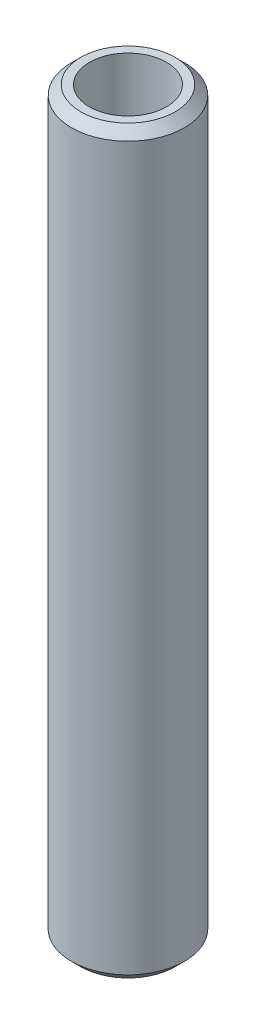
ISO-10303-21;
HEADER;
FILE_DESCRIPTION(('STEP AP214'),'2;1');
FILE_NAME('part.step','',(''),(''),'','','');
FILE_SCHEMA(('AUTOMOTIVE_DESIGN { 1 0 10303 214 1 1 1 1 }'));
ENDSEC;
DATA;
#1=APPLICATION_CONTEXT('core data for automotive mechanical design processes');
#2=APPLICATION_PROTOCOL_DEFINITION('international standard','automotive_design',2000,#1);
#3=PRODUCT_CONTEXT('',#1,'mechanical');
#4=PRODUCT('Part','Part','',(#3));
#5=PRODUCT_RELATED_PRODUCT_CATEGORY('part','',(#4));
#6=PRODUCT_DEFINITION_FORMATION('','',#4);
#7=PRODUCT_DEFINITION_CONTEXT('part definition',#1,'design');
#8=PRODUCT_DEFINITION('design','',#6,#7);
#9=PRODUCT_DEFINITION_SHAPE('','',#8);
#10=(LENGTH_UNIT() NAMED_UNIT(*) SI_UNIT(.MILLI.,.METRE.));
#11=(NAMED_UNIT(*) PLANE_ANGLE_UNIT() SI_UNIT($,.RADIAN.));
#12=(NAMED_UNIT(*) SI_UNIT($,.STERADIAN.) SOLID_ANGLE_UNIT());
#13=UNCERTAINTY_MEASURE_WITH_UNIT(LENGTH_MEASURE(1.E-05),#10,'distance_accuracy_value','');
#14=(GEOMETRIC_REPRESENTATION_CONTEXT(3) GLOBAL_UNCERTAINTY_ASSIGNED_CONTEXT((#13)) GLOBAL_UNIT_ASSIGNED_CONTEXT((#10,
#11,#12)) REPRESENTATION_CONTEXT('',''));
#15=CARTESIAN_POINT('',(0.,0.,0.));
#16=DIRECTION('',(0.,0.,1.));
#17=DIRECTION('',(1.,0.,0.));
#18=AXIS2_PLACEMENT_3D('',#15,#16,#17);
#19=CARTESIAN_POINT('',(0.,295.145872084196,0.));
#20=DIRECTION('',(0.,-1.,0.));
#21=DIRECTION('',(0.,0.,-1.));
#22=AXIS2_PLACEMENT_3D('',#19,#20,#21);
#23=CYLINDRICAL_SURFACE('',#22,22.5);
#24=CARTESIAN_POINT('',(0.,291.471292037879,0.));
#25=DIRECTION('',(0.,1.,0.));
#26=DIRECTION('',(0.,0.,1.));
#27=AXIS2_PLACEMENT_3D('',#24,#25,#26);
#28=CIRCLE('',#27,22.5);
#29=CARTESIAN_POINT('',(0.,291.471292037879,22.5));
#30=VERTEX_POINT('',#29);
#31=EDGE_CURVE('E50',#30,#30,#28,.F.);
#32=ORIENTED_EDGE('',*,*,#31,.T.);
#33=EDGE_LOOP('',(#32));
#34=FACE_BOUND('',#33,.T.);
#35=CARTESIAN_POINT('',(0.,3.67458004631654,0.));
#36=DIRECTION('',(0.,1.,0.));
#37=DIRECTION('',(0.,0.,1.));
#38=AXIS2_PLACEMENT_3D('',#35,#36,#37);
#39=CIRCLE('',#38,22.5);
#40=CARTESIAN_POINT('',(0.,3.67458004631654,22.5));
#41=VERTEX_POINT('',#40);
#42=EDGE_CURVE('E51',#41,#41,#39,.T.);
#43=ORIENTED_EDGE('',*,*,#42,.T.);
#44=EDGE_LOOP('',(#43));
#45=FACE_BOUND('',#44,.T.);
#46=ADVANCED_FACE('F39',(#34,#45),#23,.T.);
#47=CARTESIAN_POINT('',(0.,295.145872084196,0.));
#48=DIRECTION('',(0.,1.,0.));
#49=DIRECTION('',(0.,0.,1.));
#50=AXIS2_PLACEMENT_3D('',#47,#48,#49);
#51=PLANE('',#50);
#52=CARTESIAN_POINT('',(0.,295.145872084196,0.));
#53=DIRECTION('',(0.,1.,0.));
#54=DIRECTION('',(0.,0.,1.));
#55=AXIS2_PLACEMENT_3D('',#52,#53,#54);
#56=CIRCLE('',#55,18.8254199536835);
#57=CARTESIAN_POINT('',(0.,295.145872084196,18.8254199536835));
#58=VERTEX_POINT('',#57);
#59=EDGE_CURVE('E54',#58,#58,#56,.T.);
#60=ORIENTED_EDGE('',*,*,#59,.T.);
#61=EDGE_LOOP('',(#60));
#62=FACE_BOUND('',#61,.T.);
#63=CARTESIAN_POINT('',(0.,295.145872084196,0.));
#64=DIRECTION('',(0.,1.,0.));
#65=DIRECTION('',(0.,0.,1.));
#66=AXIS2_PLACEMENT_3D('',#63,#64,#65);
#67=CIRCLE('',#66,15.3808582664722);
#68=CARTESIAN_POINT('',(0.,295.145872084196,15.3808582664722));
#69=VERTEX_POINT('',#68);
#70=EDGE_CURVE('E58',#69,#69,#67,.T.);
#71=ORIENTED_EDGE('',*,*,#70,.F.);
#72=EDGE_LOOP('',(#71));
#73=FACE_BOUND('',#72,.T.);
#74=ADVANCED_FACE('F69',(#62,#73),#51,.T.);
#75=CARTESIAN_POINT('',(0.,0.,0.));
#76=DIRECTION('',(0.,1.,0.));
#77=DIRECTION('',(0.,0.,1.));
#78=AXIS2_PLACEMENT_3D('',#75,#76,#77);
#79=PLANE('',#78);
#80=CARTESIAN_POINT('',(0.,0.,0.));
#81=DIRECTION('',(0.,1.,0.));
#82=DIRECTION('',(0.,0.,1.));
#83=AXIS2_PLACEMENT_3D('',#80,#81,#82);
#84=CIRCLE('',#83,18.8254199536834);
#85=CARTESIAN_POINT('',(0.,0.,18.8254199536834));
#86=VERTEX_POINT('',#85);
#87=EDGE_CURVE('E10',#86,#86,#84,.F.);
#88=ORIENTED_EDGE('',*,*,#87,.T.);
#89=EDGE_LOOP('',(#88));
#90=FACE_BOUND('',#89,.T.);
#91=CARTESIAN_POINT('',(0.,0.,0.));
#92=DIRECTION('',(0.,1.,0.));
#93=DIRECTION('',(0.,0.,1.));
#94=AXIS2_PLACEMENT_3D('',#91,#92,#93);
#95=CIRCLE('',#94,15.3808582664722);
#96=CARTESIAN_POINT('',(0.,0.,15.3808582664722));
#97=VERTEX_POINT('',#96);
#98=EDGE_CURVE('E63',#97,#97,#95,.T.);
#99=ORIENTED_EDGE('',*,*,#98,.T.);
#100=EDGE_LOOP('',(#99));
#101=FACE_BOUND('',#100,.T.);
#102=ADVANCED_FACE('F75',(#90,#101),#79,.F.);
#103=CARTESIAN_POINT('',(0.,295.145872084196,0.));
#104=DIRECTION('',(0.,-1.,0.));
#105=DIRECTION('',(0.,0.,-1.));
#106=AXIS2_PLACEMENT_3D('',#103,#104,#105);
#107=CYLINDRICAL_SURFACE('',#106,15.3808582664722);
#108=ORIENTED_EDGE('',*,*,#70,.T.);
#109=EDGE_LOOP('',(#108));
#110=FACE_BOUND('',#109,.T.);
#111=ORIENTED_EDGE('',*,*,#98,.F.);
#112=EDGE_LOOP('',(#111));
#113=FACE_BOUND('',#112,.T.);
#114=ADVANCED_FACE('F70',(#110,#113),#107,.F.);
#115=CARTESIAN_POINT('',(0.,295.145872084196,0.));
#116=DIRECTION('',(0.,-1.,0.));
#117=DIRECTION('',(0.,0.,-1.));
#118=AXIS2_PLACEMENT_3D('',#115,#116,#117);
#119=CONICAL_SURFACE('',#118,18.8254199536835,0.785398163397438);
#120=ORIENTED_EDGE('',*,*,#31,.F.);
#121=EDGE_LOOP('',(#120));
#122=FACE_BOUND('',#121,.T.);
#123=ORIENTED_EDGE('',*,*,#59,.F.);
#124=EDGE_LOOP('',(#123));
#125=FACE_BOUND('',#124,.T.);
#126=ADVANCED_FACE('F81',(#122,#125),#119,.T.);
#127=CARTESIAN_POINT('',(0.,3.67458004631654,0.));
#128=DIRECTION('',(0.,1.,0.));
#129=DIRECTION('',(0.,0.,1.));
#130=AXIS2_PLACEMENT_3D('',#127,#128,#129);
#131=CONICAL_SURFACE('',#130,22.5,0.785398163397454);
#132=CARTESIAN_POINT('',(0.,0.,18.8254199536834));
#133=CARTESIAN_POINT('',(0.,0.0382768754824636,18.8636968291659));
#134=CARTESIAN_POINT('',(0.,0.0765537509649276,18.9019737046483));
#135=CARTESIAN_POINT('',(0.,0.153107501929856,18.9785274556133));
#136=CARTESIAN_POINT('',(0.,0.19138437741232,19.0168043310957));
#137=CARTESIAN_POINT('',(0.,0.267938128377248,19.0933580820607));
#138=CARTESIAN_POINT('',(0.,0.306215003859712,19.1316349575431));
#139=CARTESIAN_POINT('',(0.,0.38276875482464,19.2081887085081));
#140=CARTESIAN_POINT('',(0.,0.421045630307104,19.2464655839905));
#141=CARTESIAN_POINT('',(0.,0.497599381272032,19.3230193349555));
#142=CARTESIAN_POINT('',(0.,0.535876256754496,19.3612962104379));
#143=CARTESIAN_POINT('',(0.,0.612430007719424,19.4378499614028));
#144=CARTESIAN_POINT('',(0.,0.650706883201888,19.4761268368853));
#145=CARTESIAN_POINT('',(0.,0.727260634166816,19.5526805878502));
#146=CARTESIAN_POINT('',(0.,0.76553750964928,19.5909574633327));
#147=CARTESIAN_POINT('',(0.,0.842091260614208,19.6675112142976));
#148=CARTESIAN_POINT('',(0.,0.880368136096671,19.7057880897801));
#149=CARTESIAN_POINT('',(0.,0.9569218870616,19.782341840745));
#150=CARTESIAN_POINT('',(0.,0.995198762544064,19.8206187162275));
#151=CARTESIAN_POINT('',(0.,1.07175251350899,19.8971724671924));
#152=CARTESIAN_POINT('',(0.,1.11002938899146,19.9354493426749));
#153=CARTESIAN_POINT('',(0.,1.18658313995638,20.0120030936398));
#154=CARTESIAN_POINT('',(0.,1.22486001543885,20.0502799691223));
#155=CARTESIAN_POINT('',(0.,1.30141376640378,20.1268337200872));
#156=CARTESIAN_POINT('',(0.,1.33969064188624,20.1651105955697));
#157=CARTESIAN_POINT('',(0.,1.41624439285117,20.2416643465346));
#158=CARTESIAN_POINT('',(0.,1.45452126833363,20.2799412220171));
#159=CARTESIAN_POINT('',(0.,1.53107501929856,20.356494972982));
#160=CARTESIAN_POINT('',(0.,1.56935189478102,20.3947718484645));
#161=CARTESIAN_POINT('',(0.,1.64590564574595,20.4713255994294));
#162=CARTESIAN_POINT('',(0.,1.68418252122842,20.5096024749119));
#163=CARTESIAN_POINT('',(0.,1.76073627219334,20.5861562258768));
#164=CARTESIAN_POINT('',(0.,1.79901314767581,20.6244331013592));
#165=CARTESIAN_POINT('',(0.,1.87556689864074,20.7009868523242));
#166=CARTESIAN_POINT('',(0.,1.9138437741232,20.7392637278066));
#167=CARTESIAN_POINT('',(0.,1.99039752508813,20.8158174787716));
#168=CARTESIAN_POINT('',(0.,2.02867440057059,20.854094354254));
#169=CARTESIAN_POINT('',(0.,2.10522815153552,20.930648105219));
#170=CARTESIAN_POINT('',(0.,2.14350502701798,20.9689249807014));
#171=CARTESIAN_POINT('',(0.,2.22005877798291,21.0454787316664));
#172=CARTESIAN_POINT('',(0.,2.25833565346538,21.0837556071488));
#173=CARTESIAN_POINT('',(0.,2.3348894044303,21.1603093581137));
#174=CARTESIAN_POINT('',(0.,2.37316627991277,21.1985862335962));
#175=CARTESIAN_POINT('',(0.,2.4497200308777,21.2751399845611));
#176=CARTESIAN_POINT('',(0.,2.48799690636016,21.3134168600436));
#177=CARTESIAN_POINT('',(0.,2.56455065732509,21.3899706110085));
#178=CARTESIAN_POINT('',(0.,2.60282753280755,21.428247486491));
#179=CARTESIAN_POINT('',(0.,2.67938128377248,21.5048012374559));
#180=CARTESIAN_POINT('',(0.,2.71765815925494,21.5430781129384));
#181=CARTESIAN_POINT('',(0.,2.79421191021987,21.6196318639033));
#182=CARTESIAN_POINT('',(0.,2.83248878570234,21.6579087393858));
#183=CARTESIAN_POINT('',(0.,2.90904253666726,21.7344624903507));
#184=CARTESIAN_POINT('',(0.,2.94731941214973,21.7727393658332));
#185=CARTESIAN_POINT('',(0.,3.02387316311466,21.8492931167981));
#186=CARTESIAN_POINT('',(0.,3.06215003859712,21.8875699922806));
#187=CARTESIAN_POINT('',(0.,3.13870378956205,21.9641237432455));
#188=CARTESIAN_POINT('',(0.,3.17698066504451,22.002400618728));
#189=CARTESIAN_POINT('',(0.,3.25353441600944,22.0789543696929));
#190=CARTESIAN_POINT('',(0.,3.2918112914919,22.1172312451754));
#191=CARTESIAN_POINT('',(0.,3.36836504245683,22.1937849961403));
#192=CARTESIAN_POINT('',(0.,3.4066419179393,22.2320618716228));
#193=CARTESIAN_POINT('',(0.,3.48319566890422,22.3086156225877));
#194=CARTESIAN_POINT('',(0.,3.52147254438669,22.3468924980701));
#195=CARTESIAN_POINT('',(0.,3.59802629535162,22.4234462490351));
#196=CARTESIAN_POINT('',(0.,3.63630317083408,22.4617231245175));
#197=CARTESIAN_POINT('',(0.,3.67458004631654,22.5));
#198=B_SPLINE_CURVE_WITH_KNOTS('',3,(#132,#133,#134,#135,#136,#137,#138,#139,#140,#141,#142,
#143,#144,#145,#146,#147,#148,#149,#150,#151,#152,#153,#154,#155,#156,#157,#158,#159,#160,#161,
#162,#163,#164,#165,#166,#167,#168,#169,#170,#171,#172,#173,#174,#175,#176,#177,#178,#179,#180,
#181,#182,#183,#184,#185,#186,#187,#188,#189,#190,#191,#192,#193,#194,#195,#196,#197),
.UNSPECIFIED.,.F.,.F.,(4,2,2,2,2,2,2,2,2,2,2,2,2,2,2,2,2,2,2,2,2,2,2,2,2,2,2,2,2,2,2,2,4),(0.,
0.162395029297702,0.324790058595403,0.487185087893105,0.649580117190807,0.811975146488508,
0.97437017578621,1.13676520508391,1.29916023438161,1.46155526367931,1.62395029297701,
1.78634532227472,1.94874035157242,2.11113538087012,2.27353041016782,2.43592543946552,
2.59832046876322,2.76071549806092,2.92311052735862,3.08550555665633,3.24790058595403,
3.41029561525173,3.57269064454943,3.73508567384713,3.89748070314483,4.05987573244253,
4.22227076174024,4.38466579103793,4.54706082033564,4.70945584963334,4.87185087893104,
5.03424590822874,5.19664093752644),.UNSPECIFIED.);
#199=EDGE_CURVE('BSEAM45',#86,#41,#198,.T.);
#200=ORIENTED_EDGE('',*,*,#87,.F.);
#201=ORIENTED_EDGE('',*,*,#42,.F.);
#202=ORIENTED_EDGE('',*,*,#199,.T.);
#203=ORIENTED_EDGE('',*,*,#199,.F.);
#204=EDGE_LOOP('',(#200,#202,#201,#203));
#205=FACE_BOUND('',#204,.T.);
#206=ADVANCED_FACE('F45',(#205),#131,.T.);
#207=CLOSED_SHELL('',(#46,#74,#102,#114,#126,#206));
#208=MANIFOLD_SOLID_BREP('B2',#207);
#209=ADVANCED_BREP_SHAPE_REPRESENTATION('',(#18,#208),#14);
#210=SHAPE_DEFINITION_REPRESENTATION(#9,#209);
ENDSEC;
END-ISO-10303-21;
